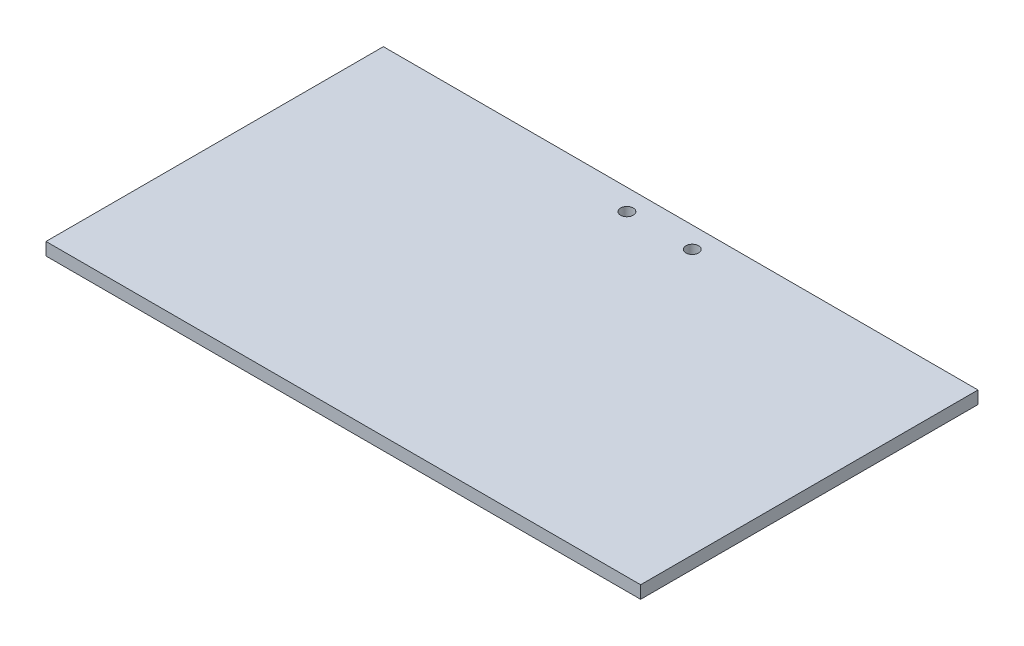
ISO-10303-21;
HEADER;
FILE_DESCRIPTION(('STEP AP214'),'2;1');
FILE_NAME('part.step','',(''),(''),'','','');
FILE_SCHEMA(('AUTOMOTIVE_DESIGN { 1 0 10303 214 1 1 1 1 }'));
ENDSEC;
DATA;
#1=APPLICATION_CONTEXT('core data for automotive mechanical design processes');
#2=APPLICATION_PROTOCOL_DEFINITION('international standard','automotive_design',2000,#1);
#3=PRODUCT_CONTEXT('',#1,'mechanical');
#4=PRODUCT('Part','Part','',(#3));
#5=PRODUCT_RELATED_PRODUCT_CATEGORY('part','',(#4));
#6=PRODUCT_DEFINITION_FORMATION('','',#4);
#7=PRODUCT_DEFINITION_CONTEXT('part definition',#1,'design');
#8=PRODUCT_DEFINITION('design','',#6,#7);
#9=PRODUCT_DEFINITION_SHAPE('','',#8);
#10=(LENGTH_UNIT() NAMED_UNIT(*) SI_UNIT(.MILLI.,.METRE.));
#11=(NAMED_UNIT(*) PLANE_ANGLE_UNIT() SI_UNIT($,.RADIAN.));
#12=(NAMED_UNIT(*) SI_UNIT($,.STERADIAN.) SOLID_ANGLE_UNIT());
#13=UNCERTAINTY_MEASURE_WITH_UNIT(LENGTH_MEASURE(1.E-05),#10,'distance_accuracy_value','');
#14=(GEOMETRIC_REPRESENTATION_CONTEXT(3) GLOBAL_UNCERTAINTY_ASSIGNED_CONTEXT((#13)) GLOBAL_UNIT_ASSIGNED_CONTEXT((#10,
#11,#12)) REPRESENTATION_CONTEXT('',''));
#15=CARTESIAN_POINT('',(0.,0.,0.));
#16=DIRECTION('',(0.,0.,1.));
#17=DIRECTION('',(1.,0.,0.));
#18=AXIS2_PLACEMENT_3D('',#15,#16,#17);
#19=CARTESIAN_POINT('',(0.,3.,0.));
#20=DIRECTION('',(-1.,0.,0.));
#21=DIRECTION('',(0.,0.,1.));
#22=AXIS2_PLACEMENT_3D('',#19,#20,#21);
#23=PLANE('',#22);
#24=DIRECTION('',(0.,0.,-1.));
#25=VECTOR('',#24,1.);
#26=CARTESIAN_POINT('',(0.,0.,0.));
#27=LINE('',#26,#25);
#28=CARTESIAN_POINT('',(0.,0.,0.));
#29=VERTEX_POINT('',#28);
#30=CARTESIAN_POINT('',(0.,0.,-80.));
#31=VERTEX_POINT('',#30);
#32=EDGE_CURVE('E95',#29,#31,#27,.T.);
#33=ORIENTED_EDGE('',*,*,#32,.T.);
#34=DIRECTION('',(0.,-1.,0.));
#35=VECTOR('',#34,1.);
#36=CARTESIAN_POINT('',(0.,3.,-80.));
#37=LINE('',#36,#35);
#38=CARTESIAN_POINT('',(0.,3.,-80.));
#39=VERTEX_POINT('',#38);
#40=EDGE_CURVE('E11',#39,#31,#37,.T.);
#41=ORIENTED_EDGE('',*,*,#40,.F.);
#42=DIRECTION('',(0.,0.,-1.));
#43=VECTOR('',#42,1.);
#44=CARTESIAN_POINT('',(0.,3.,0.));
#45=LINE('',#44,#43);
#46=CARTESIAN_POINT('',(0.,3.,0.));
#47=VERTEX_POINT('',#46);
#48=EDGE_CURVE('E83',#47,#39,#45,.T.);
#49=ORIENTED_EDGE('',*,*,#48,.F.);
#50=DIRECTION('',(0.,-1.,0.));
#51=VECTOR('',#50,1.);
#52=CARTESIAN_POINT('',(0.,3.,0.));
#53=LINE('',#52,#51);
#54=EDGE_CURVE('E91',#47,#29,#53,.T.);
#55=ORIENTED_EDGE('',*,*,#54,.T.);
#56=EDGE_LOOP('',(#33,#41,#49,#55));
#57=FACE_BOUND('',#56,.T.);
#58=ADVANCED_FACE('F32',(#57),#23,.F.);
#59=CARTESIAN_POINT('',(0.,3.,-80.));
#60=DIRECTION('',(0.,0.,1.));
#61=DIRECTION('',(1.,0.,0.));
#62=AXIS2_PLACEMENT_3D('',#59,#60,#61);
#63=PLANE('',#62);
#64=DIRECTION('',(-1.,0.,0.));
#65=VECTOR('',#64,1.);
#66=CARTESIAN_POINT('',(0.,0.,-80.));
#67=LINE('',#66,#65);
#68=CARTESIAN_POINT('',(-141.,0.,-80.));
#69=VERTEX_POINT('',#68);
#70=EDGE_CURVE('E87',#31,#69,#67,.T.);
#71=ORIENTED_EDGE('',*,*,#70,.T.);
#72=DIRECTION('',(0.,-1.,0.));
#73=VECTOR('',#72,1.);
#74=CARTESIAN_POINT('',(-141.,3.,-80.));
#75=LINE('',#74,#73);
#76=CARTESIAN_POINT('',(-141.,3.,-80.));
#77=VERTEX_POINT('',#76);
#78=EDGE_CURVE('E40',#77,#69,#75,.T.);
#79=ORIENTED_EDGE('',*,*,#78,.F.);
#80=DIRECTION('',(-1.,0.,0.));
#81=VECTOR('',#80,1.);
#82=CARTESIAN_POINT('',(0.,3.,-80.));
#83=LINE('',#82,#81);
#84=EDGE_CURVE('E78',#39,#77,#83,.T.);
#85=ORIENTED_EDGE('',*,*,#84,.F.);
#86=ORIENTED_EDGE('',*,*,#40,.T.);
#87=EDGE_LOOP('',(#71,#79,#85,#86));
#88=FACE_BOUND('',#87,.T.);
#89=ADVANCED_FACE('F86',(#88),#63,.F.);
#90=CARTESIAN_POINT('',(-141.,3.,0.));
#91=DIRECTION('',(1.,0.,0.));
#92=DIRECTION('',(0.,0.,-1.));
#93=AXIS2_PLACEMENT_3D('',#90,#91,#92);
#94=PLANE('',#93);
#95=DIRECTION('',(0.,0.,1.));
#96=VECTOR('',#95,1.);
#97=CARTESIAN_POINT('',(-141.,0.,0.));
#98=LINE('',#97,#96);
#99=CARTESIAN_POINT('',(-141.,0.,0.));
#100=VERTEX_POINT('',#99);
#101=EDGE_CURVE('E65',#69,#100,#98,.T.);
#102=ORIENTED_EDGE('',*,*,#101,.T.);
#103=DIRECTION('',(0.,-1.,0.));
#104=VECTOR('',#103,1.);
#105=CARTESIAN_POINT('',(-141.,3.,0.));
#106=LINE('',#105,#104);
#107=CARTESIAN_POINT('',(-141.,3.,0.));
#108=VERTEX_POINT('',#107);
#109=EDGE_CURVE('E88',#108,#100,#106,.T.);
#110=ORIENTED_EDGE('',*,*,#109,.F.);
#111=DIRECTION('',(0.,0.,1.));
#112=VECTOR('',#111,1.);
#113=CARTESIAN_POINT('',(-141.,3.,0.));
#114=LINE('',#113,#112);
#115=EDGE_CURVE('E81',#77,#108,#114,.T.);
#116=ORIENTED_EDGE('',*,*,#115,.F.);
#117=ORIENTED_EDGE('',*,*,#78,.T.);
#118=EDGE_LOOP('',(#102,#110,#116,#117));
#119=FACE_BOUND('',#118,.T.);
#120=ADVANCED_FACE('F89',(#119),#94,.F.);
#121=CARTESIAN_POINT('',(0.,3.,0.));
#122=DIRECTION('',(0.,0.,-1.));
#123=DIRECTION('',(-1.,0.,0.));
#124=AXIS2_PLACEMENT_3D('',#121,#122,#123);
#125=PLANE('',#124);
#126=DIRECTION('',(1.,0.,0.));
#127=VECTOR('',#126,1.);
#128=CARTESIAN_POINT('',(0.,0.,0.));
#129=LINE('',#128,#127);
#130=EDGE_CURVE('E71',#100,#29,#129,.T.);
#131=ORIENTED_EDGE('',*,*,#130,.T.);
#132=ORIENTED_EDGE('',*,*,#54,.F.);
#133=DIRECTION('',(1.,0.,0.));
#134=VECTOR('',#133,1.);
#135=CARTESIAN_POINT('',(0.,3.,0.));
#136=LINE('',#135,#134);
#137=EDGE_CURVE('E48',#108,#47,#136,.T.);
#138=ORIENTED_EDGE('',*,*,#137,.F.);
#139=ORIENTED_EDGE('',*,*,#109,.T.);
#140=EDGE_LOOP('',(#131,#132,#138,#139));
#141=FACE_BOUND('',#140,.T.);
#142=ADVANCED_FACE('F103',(#141),#125,.F.);
#143=CARTESIAN_POINT('',(0.,3.,0.));
#144=DIRECTION('',(0.,1.,0.));
#145=DIRECTION('',(0.,0.,1.));
#146=AXIS2_PLACEMENT_3D('',#143,#144,#145);
#147=PLANE('',#146);
#148=CARTESIAN_POINT('',(-62.75,3.,-75.));
#149=DIRECTION('',(0.,1.,0.));
#150=DIRECTION('',(0.,0.,1.));
#151=AXIS2_PLACEMENT_3D('',#148,#149,#150);
#152=CIRCLE('',#151,1.5);
#153=CARTESIAN_POINT('',(-62.75,3.,-73.5));
#154=VERTEX_POINT('',#153);
#155=EDGE_CURVE('E115',#154,#154,#152,.T.);
#156=ORIENTED_EDGE('',*,*,#155,.F.);
#157=EDGE_LOOP('',(#156));
#158=FACE_BOUND('',#157,.T.);
#159=CARTESIAN_POINT('',(-78.25,3.,-75.));
#160=DIRECTION('',(0.,1.,0.));
#161=DIRECTION('',(0.,0.,1.));
#162=AXIS2_PLACEMENT_3D('',#159,#160,#161);
#163=CIRCLE('',#162,1.5);
#164=CARTESIAN_POINT('',(-78.25,3.,-73.5));
#165=VERTEX_POINT('',#164);
#166=EDGE_CURVE('E109',#165,#165,#163,.T.);
#167=ORIENTED_EDGE('',*,*,#166,.F.);
#168=EDGE_LOOP('',(#167));
#169=FACE_BOUND('',#168,.T.);
#170=ORIENTED_EDGE('',*,*,#48,.T.);
#171=ORIENTED_EDGE('',*,*,#84,.T.);
#172=ORIENTED_EDGE('',*,*,#115,.T.);
#173=ORIENTED_EDGE('',*,*,#137,.T.);
#174=EDGE_LOOP('',(#170,#171,#172,#173));
#175=FACE_BOUND('',#174,.T.);
#176=ADVANCED_FACE('F79',(#158,#169,#175),#147,.T.);
#177=CARTESIAN_POINT('',(0.,0.,0.));
#178=DIRECTION('',(0.,1.,0.));
#179=DIRECTION('',(0.,0.,1.));
#180=AXIS2_PLACEMENT_3D('',#177,#178,#179);
#181=PLANE('',#180);
#182=CARTESIAN_POINT('',(-62.75,0.,-75.));
#183=DIRECTION('',(0.,1.,0.));
#184=DIRECTION('',(0.,0.,1.));
#185=AXIS2_PLACEMENT_3D('',#182,#183,#184);
#186=CIRCLE('',#185,1.5);
#187=CARTESIAN_POINT('',(-62.75,0.,-73.5));
#188=VERTEX_POINT('',#187);
#189=EDGE_CURVE('E112',#188,#188,#186,.T.);
#190=ORIENTED_EDGE('',*,*,#189,.T.);
#191=EDGE_LOOP('',(#190));
#192=FACE_BOUND('',#191,.T.);
#193=CARTESIAN_POINT('',(-78.25,0.,-75.));
#194=DIRECTION('',(0.,1.,0.));
#195=DIRECTION('',(0.,0.,1.));
#196=AXIS2_PLACEMENT_3D('',#193,#194,#195);
#197=CIRCLE('',#196,1.5);
#198=CARTESIAN_POINT('',(-78.25,0.,-73.5));
#199=VERTEX_POINT('',#198);
#200=EDGE_CURVE('E98',#199,#199,#197,.T.);
#201=ORIENTED_EDGE('',*,*,#200,.T.);
#202=EDGE_LOOP('',(#201));
#203=FACE_BOUND('',#202,.T.);
#204=ORIENTED_EDGE('',*,*,#32,.F.);
#205=ORIENTED_EDGE('',*,*,#130,.F.);
#206=ORIENTED_EDGE('',*,*,#101,.F.);
#207=ORIENTED_EDGE('',*,*,#70,.F.);
#208=EDGE_LOOP('',(#204,#205,#206,#207));
#209=FACE_BOUND('',#208,.T.);
#210=ADVANCED_FACE('F106',(#192,#203,#209),#181,.F.);
#211=CARTESIAN_POINT('',(-78.25,0.,-75.));
#212=DIRECTION('',(0.,1.,0.));
#213=DIRECTION('',(0.,0.,1.));
#214=AXIS2_PLACEMENT_3D('',#211,#212,#213);
#215=CYLINDRICAL_SURFACE('',#214,1.5);
#216=ORIENTED_EDGE('',*,*,#200,.F.);
#217=EDGE_LOOP('',(#216));
#218=FACE_BOUND('',#217,.T.);
#219=ORIENTED_EDGE('',*,*,#166,.T.);
#220=EDGE_LOOP('',(#219));
#221=FACE_BOUND('',#220,.T.);
#222=ADVANCED_FACE('F126',(#218,#221),#215,.F.);
#223=CARTESIAN_POINT('',(-62.75,0.,-75.));
#224=DIRECTION('',(0.,1.,0.));
#225=DIRECTION('',(0.,0.,1.));
#226=AXIS2_PLACEMENT_3D('',#223,#224,#225);
#227=CYLINDRICAL_SURFACE('',#226,1.5);
#228=ORIENTED_EDGE('',*,*,#189,.F.);
#229=EDGE_LOOP('',(#228));
#230=FACE_BOUND('',#229,.T.);
#231=ORIENTED_EDGE('',*,*,#155,.T.);
#232=EDGE_LOOP('',(#231));
#233=FACE_BOUND('',#232,.T.);
#234=ADVANCED_FACE('F123',(#230,#233),#227,.F.);
#235=CLOSED_SHELL('',(#58,#89,#120,#142,#176,#210,#222,#234));
#236=MANIFOLD_SOLID_BREP('B2',#235);
#237=ADVANCED_BREP_SHAPE_REPRESENTATION('',(#18,#236),#14);
#238=SHAPE_DEFINITION_REPRESENTATION(#9,#237);
ENDSEC;
END-ISO-10303-21;
